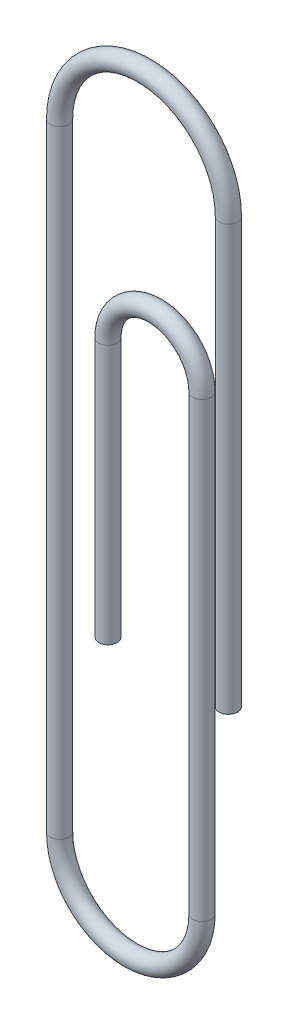
ISO-10303-21;
HEADER;
FILE_DESCRIPTION(('STEP AP214'),'2;1');
FILE_NAME('part.step','',(''),(''),'','','');
FILE_SCHEMA(('AUTOMOTIVE_DESIGN { 1 0 10303 214 1 1 1 1 }'));
ENDSEC;
DATA;
#1=APPLICATION_CONTEXT('core data for automotive mechanical design processes');
#2=APPLICATION_PROTOCOL_DEFINITION('international standard','automotive_design',2000,#1);
#3=PRODUCT_CONTEXT('',#1,'mechanical');
#4=PRODUCT('Part','Part','',(#3));
#5=PRODUCT_RELATED_PRODUCT_CATEGORY('part','',(#4));
#6=PRODUCT_DEFINITION_FORMATION('','',#4);
#7=PRODUCT_DEFINITION_CONTEXT('part definition',#1,'design');
#8=PRODUCT_DEFINITION('design','',#6,#7);
#9=PRODUCT_DEFINITION_SHAPE('','',#8);
#10=(LENGTH_UNIT() NAMED_UNIT(*) SI_UNIT(.MILLI.,.METRE.));
#11=(NAMED_UNIT(*) PLANE_ANGLE_UNIT() SI_UNIT($,.RADIAN.));
#12=(NAMED_UNIT(*) SI_UNIT($,.STERADIAN.) SOLID_ANGLE_UNIT());
#13=UNCERTAINTY_MEASURE_WITH_UNIT(LENGTH_MEASURE(1.E-05),#10,'distance_accuracy_value','');
#14=(GEOMETRIC_REPRESENTATION_CONTEXT(3) GLOBAL_UNCERTAINTY_ASSIGNED_CONTEXT((#13)) GLOBAL_UNIT_ASSIGNED_CONTEXT((#10,
#11,#12)) REPRESENTATION_CONTEXT('',''));
#15=CARTESIAN_POINT('',(0.,0.,0.));
#16=DIRECTION('',(0.,0.,1.));
#17=DIRECTION('',(1.,0.,0.));
#18=AXIS2_PLACEMENT_3D('',#15,#16,#17);
#19=CARTESIAN_POINT('',(0.,0.,0.));
#20=DIRECTION('',(0.,-1.,0.));
#21=DIRECTION('',(0.,0.,1.));
#22=AXIS2_PLACEMENT_3D('',#19,#20,#21);
#23=PLANE('',#22);
#24=CARTESIAN_POINT('',(0.,0.,0.));
#25=DIRECTION('',(0.,-1.,0.));
#26=DIRECTION('',(0.,0.,1.));
#27=AXIS2_PLACEMENT_3D('',#24,#25,#26);
#28=CIRCLE('',#27,0.38);
#29=CARTESIAN_POINT('',(0.,0.,0.38));
#30=VERTEX_POINT('',#29);
#31=EDGE_CURVE('E61',#30,#30,#28,.T.);
#32=ORIENTED_EDGE('',*,*,#31,.T.);
#33=EDGE_LOOP('',(#32));
#34=FACE_BOUND('',#33,.T.);
#35=ADVANCED_FACE('F49',(#34),#23,.T.);
#36=CARTESIAN_POINT('',(-4.93000000000001,0.,0.));
#37=DIRECTION('',(0.,1.,0.));
#38=DIRECTION('',(0.,0.,1.));
#39=AXIS2_PLACEMENT_3D('',#36,#37,#38);
#40=PLANE('',#39);
#41=CARTESIAN_POINT('',(-4.93000000000001,0.,0.));
#42=DIRECTION('',(0.,1.,0.));
#43=DIRECTION('',(0.,0.,1.));
#44=AXIS2_PLACEMENT_3D('',#41,#42,#43);
#45=CIRCLE('',#44,0.38);
#46=CARTESIAN_POINT('',(-4.93000000000001,0.,0.38));
#47=VERTEX_POINT('',#46);
#48=EDGE_CURVE('E12',#47,#47,#45,.T.);
#49=ORIENTED_EDGE('',*,*,#48,.F.);
#50=EDGE_LOOP('',(#49));
#51=FACE_BOUND('',#50,.T.);
#52=ADVANCED_FACE('F67',(#51),#40,.F.);
#53=CARTESIAN_POINT('',(0.,0.,0.));
#54=DIRECTION('',(0.,1.,0.));
#55=DIRECTION('',(0.,0.,1.));
#56=AXIS2_PLACEMENT_3D('',#53,#54,#55);
#57=CYLINDRICAL_SURFACE('',#56,0.38);
#58=CARTESIAN_POINT('',(0.,17.38,0.));
#59=DIRECTION('',(0.,-1.,0.));
#60=DIRECTION('',(0.,0.,1.));
#61=AXIS2_PLACEMENT_3D('',#58,#59,#60);
#62=CIRCLE('',#61,0.38);
#63=CARTESIAN_POINT('',(0.380000000000001,17.38,0.));
#64=VERTEX_POINT('',#63);
#65=EDGE_CURVE('E109',#64,#64,#62,.T.);
#66=ORIENTED_EDGE('',*,*,#65,.T.);
#67=EDGE_LOOP('',(#66));
#68=FACE_BOUND('',#67,.T.);
#69=ORIENTED_EDGE('',*,*,#31,.F.);
#70=EDGE_LOOP('',(#69));
#71=FACE_BOUND('',#70,.T.);
#72=ADVANCED_FACE('F69',(#68,#71),#57,.T.);
#73=CARTESIAN_POINT('',(-3.455,17.38,0.));
#74=DIRECTION('',(0.,0.,1.));
#75=DIRECTION('',(1.,0.,0.));
#76=AXIS2_PLACEMENT_3D('',#73,#74,#75);
#77=TOROIDAL_SURFACE('',#76,3.455,0.38);
#78=CARTESIAN_POINT('',(-6.91,17.38,0.));
#79=DIRECTION('',(0.,1.,0.));
#80=DIRECTION('',(0.,0.,1.));
#81=AXIS2_PLACEMENT_3D('',#78,#79,#80);
#82=CIRCLE('',#81,0.38);
#83=CARTESIAN_POINT('',(-7.29,17.38,0.));
#84=VERTEX_POINT('',#83);
#85=EDGE_CURVE('E106',#84,#84,#82,.T.);
#86=CARTESIAN_POINT('',(-3.455,17.38,0.));
#87=DIRECTION('',(0.,0.,1.));
#88=DIRECTION('',(1.,0.,0.));
#89=AXIS2_PLACEMENT_3D('',#86,#87,#88);
#90=CIRCLE('',#89,3.835);
#91=EDGE_CURVE('',#64,#84,#90,.T.);
#92=ORIENTED_EDGE('',*,*,#65,.F.);
#93=ORIENTED_EDGE('',*,*,#85,.T.);
#94=ORIENTED_EDGE('',*,*,#91,.T.);
#95=ORIENTED_EDGE('',*,*,#91,.F.);
#96=EDGE_LOOP('',(#92,#94,#93,#95));
#97=FACE_BOUND('',#96,.T.);
#98=ADVANCED_FACE('F74',(#97),#77,.T.);
#99=CARTESIAN_POINT('',(-6.91,17.38,0.));
#100=DIRECTION('',(0.,-1.,0.));
#101=DIRECTION('',(1.,0.,0.));
#102=AXIS2_PLACEMENT_3D('',#99,#100,#101);
#103=CYLINDRICAL_SURFACE('',#102,0.38);
#104=CARTESIAN_POINT('',(-6.91,-7.89,0.));
#105=DIRECTION('',(0.,1.,0.));
#106=DIRECTION('',(0.,0.,1.));
#107=AXIS2_PLACEMENT_3D('',#104,#105,#106);
#108=CIRCLE('',#107,0.38);
#109=CARTESIAN_POINT('',(-7.29,-7.89,0.));
#110=VERTEX_POINT('',#109);
#111=EDGE_CURVE('E111',#110,#110,#108,.T.);
#112=ORIENTED_EDGE('',*,*,#111,.T.);
#113=EDGE_LOOP('',(#112));
#114=FACE_BOUND('',#113,.T.);
#115=ORIENTED_EDGE('',*,*,#85,.F.);
#116=EDGE_LOOP('',(#115));
#117=FACE_BOUND('',#116,.T.);
#118=ADVANCED_FACE('F94',(#114,#117),#103,.T.);
#119=CARTESIAN_POINT('',(-3.995,-7.89,0.));
#120=DIRECTION('',(0.,0.,1.));
#121=DIRECTION('',(1.,0.,0.));
#122=AXIS2_PLACEMENT_3D('',#119,#120,#121);
#123=TOROIDAL_SURFACE('',#122,2.915,0.38);
#124=CARTESIAN_POINT('',(-1.08,-7.89,0.));
#125=DIRECTION('',(0.,-1.,0.));
#126=DIRECTION('',(0.,0.,1.));
#127=AXIS2_PLACEMENT_3D('',#124,#125,#126);
#128=CIRCLE('',#127,0.38);
#129=CARTESIAN_POINT('',(-0.700000000000001,-7.89,0.));
#130=VERTEX_POINT('',#129);
#131=EDGE_CURVE('E117',#130,#130,#128,.T.);
#132=CARTESIAN_POINT('',(-3.995,-7.89,0.));
#133=DIRECTION('',(0.,0.,1.));
#134=DIRECTION('',(1.,0.,0.));
#135=AXIS2_PLACEMENT_3D('',#132,#133,#134);
#136=CIRCLE('',#135,3.295);
#137=EDGE_CURVE('',#110,#130,#136,.T.);
#138=ORIENTED_EDGE('',*,*,#111,.F.);
#139=ORIENTED_EDGE('',*,*,#131,.T.);
#140=ORIENTED_EDGE('',*,*,#137,.T.);
#141=ORIENTED_EDGE('',*,*,#137,.F.);
#142=EDGE_LOOP('',(#138,#140,#139,#141));
#143=FACE_BOUND('',#142,.T.);
#144=ADVANCED_FACE('F90',(#143),#123,.T.);
#145=CARTESIAN_POINT('',(-1.08,-7.89,0.));
#146=DIRECTION('',(0.,1.,0.));
#147=DIRECTION('',(-1.,0.,0.));
#148=AXIS2_PLACEMENT_3D('',#145,#146,#147);
#149=CYLINDRICAL_SURFACE('',#148,0.38);
#150=CARTESIAN_POINT('',(-1.08,10.62,0.));
#151=DIRECTION('',(0.,-1.,0.));
#152=DIRECTION('',(0.,0.,1.));
#153=AXIS2_PLACEMENT_3D('',#150,#151,#152);
#154=CIRCLE('',#153,0.38);
#155=CARTESIAN_POINT('',(-0.700000000000002,10.62,0.));
#156=VERTEX_POINT('',#155);
#157=EDGE_CURVE('E120',#156,#156,#154,.T.);
#158=ORIENTED_EDGE('',*,*,#157,.T.);
#159=EDGE_LOOP('',(#158));
#160=FACE_BOUND('',#159,.T.);
#161=ORIENTED_EDGE('',*,*,#131,.F.);
#162=EDGE_LOOP('',(#161));
#163=FACE_BOUND('',#162,.T.);
#164=ADVANCED_FACE('F84',(#160,#163),#149,.T.);
#165=CARTESIAN_POINT('',(-3.005,10.62,0.));
#166=DIRECTION('',(0.,0.,1.));
#167=DIRECTION('',(1.,0.,0.));
#168=AXIS2_PLACEMENT_3D('',#165,#166,#167);
#169=TOROIDAL_SURFACE('',#168,1.925,0.38);
#170=CARTESIAN_POINT('',(-4.93000000000001,10.62,0.));
#171=DIRECTION('',(0.,1.,0.));
#172=DIRECTION('',(0.,0.,1.));
#173=AXIS2_PLACEMENT_3D('',#170,#171,#172);
#174=CIRCLE('',#173,0.38);
#175=CARTESIAN_POINT('',(-5.31000000000001,10.62,0.));
#176=VERTEX_POINT('',#175);
#177=EDGE_CURVE('E56',#176,#176,#174,.T.);
#178=CARTESIAN_POINT('',(-3.005,10.62,0.));
#179=DIRECTION('',(0.,0.,1.));
#180=DIRECTION('',(1.,0.,0.));
#181=AXIS2_PLACEMENT_3D('',#178,#179,#180);
#182=CIRCLE('',#181,2.305);
#183=EDGE_CURVE('',#156,#176,#182,.T.);
#184=ORIENTED_EDGE('',*,*,#157,.F.);
#185=ORIENTED_EDGE('',*,*,#177,.T.);
#186=ORIENTED_EDGE('',*,*,#183,.T.);
#187=ORIENTED_EDGE('',*,*,#183,.F.);
#188=EDGE_LOOP('',(#184,#186,#185,#187));
#189=FACE_BOUND('',#188,.T.);
#190=ADVANCED_FACE('F80',(#189),#169,.T.);
#191=CARTESIAN_POINT('',(-4.93000000000001,10.62,0.));
#192=DIRECTION('',(0.,-1.,0.));
#193=DIRECTION('',(0.,0.,-1.));
#194=AXIS2_PLACEMENT_3D('',#191,#192,#193);
#195=CYLINDRICAL_SURFACE('',#194,0.38);
#196=ORIENTED_EDGE('',*,*,#48,.T.);
#197=EDGE_LOOP('',(#196));
#198=FACE_BOUND('',#197,.T.);
#199=ORIENTED_EDGE('',*,*,#177,.F.);
#200=EDGE_LOOP('',(#199));
#201=FACE_BOUND('',#200,.T.);
#202=ADVANCED_FACE('F64',(#198,#201),#195,.T.);
#203=CLOSED_SHELL('',(#35,#52,#72,#98,#118,#144,#164,#190,#202));
#204=MANIFOLD_SOLID_BREP('B2',#203);
#205=ADVANCED_BREP_SHAPE_REPRESENTATION('',(#18,#204),#14);
#206=SHAPE_DEFINITION_REPRESENTATION(#9,#205);
ENDSEC;
END-ISO-10303-21;
